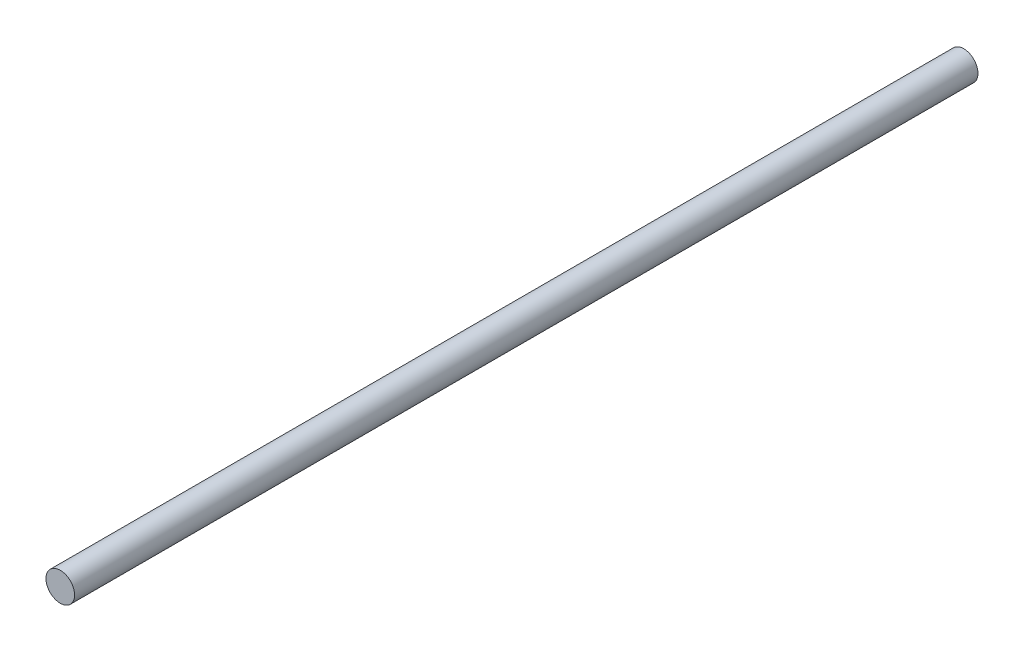
ISO-10303-21;
HEADER;
FILE_DESCRIPTION(('STEP AP214'),'2;1');
FILE_NAME('part.step','',(''),(''),'','','');
FILE_SCHEMA(('AUTOMOTIVE_DESIGN { 1 0 10303 214 1 1 1 1 }'));
ENDSEC;
DATA;
#1=APPLICATION_CONTEXT('core data for automotive mechanical design processes');
#2=APPLICATION_PROTOCOL_DEFINITION('international standard','automotive_design',2000,#1);
#3=PRODUCT_CONTEXT('',#1,'mechanical');
#4=PRODUCT('Part','Part','',(#3));
#5=PRODUCT_RELATED_PRODUCT_CATEGORY('part','',(#4));
#6=PRODUCT_DEFINITION_FORMATION('','',#4);
#7=PRODUCT_DEFINITION_CONTEXT('part definition',#1,'design');
#8=PRODUCT_DEFINITION('design','',#6,#7);
#9=PRODUCT_DEFINITION_SHAPE('','',#8);
#10=(LENGTH_UNIT() NAMED_UNIT(*) SI_UNIT(.MILLI.,.METRE.));
#11=(NAMED_UNIT(*) PLANE_ANGLE_UNIT() SI_UNIT($,.RADIAN.));
#12=(NAMED_UNIT(*) SI_UNIT($,.STERADIAN.) SOLID_ANGLE_UNIT());
#13=UNCERTAINTY_MEASURE_WITH_UNIT(LENGTH_MEASURE(1.E-05),#10,'distance_accuracy_value','');
#14=(GEOMETRIC_REPRESENTATION_CONTEXT(3) GLOBAL_UNCERTAINTY_ASSIGNED_CONTEXT((#13)) GLOBAL_UNIT_ASSIGNED_CONTEXT((#10,
#11,#12)) REPRESENTATION_CONTEXT('',''));
#15=CARTESIAN_POINT('',(0.,0.,0.));
#16=DIRECTION('',(0.,0.,1.));
#17=DIRECTION('',(1.,0.,0.));
#18=AXIS2_PLACEMENT_3D('',#15,#16,#17);
#19=CARTESIAN_POINT('',(0.,0.,152.4));
#20=DIRECTION('',(0.,0.,-1.));
#21=DIRECTION('',(-1.,0.,0.));
#22=AXIS2_PLACEMENT_3D('',#19,#20,#21);
#23=CYLINDRICAL_SURFACE('',#22,2.413);
#24=CARTESIAN_POINT('',(0.,0.,152.4));
#25=DIRECTION('',(0.,0.,1.));
#26=DIRECTION('',(1.,0.,0.));
#27=AXIS2_PLACEMENT_3D('',#24,#25,#26);
#28=CIRCLE('',#27,2.413);
#29=CARTESIAN_POINT('',(2.413,0.,152.4));
#30=VERTEX_POINT('',#29);
#31=EDGE_CURVE('E10',#30,#30,#28,.T.);
#32=ORIENTED_EDGE('',*,*,#31,.F.);
#33=EDGE_LOOP('',(#32));
#34=FACE_BOUND('',#33,.T.);
#35=CARTESIAN_POINT('',(0.,0.,0.));
#36=DIRECTION('',(0.,0.,1.));
#37=DIRECTION('',(1.,0.,0.));
#38=AXIS2_PLACEMENT_3D('',#35,#36,#37);
#39=CIRCLE('',#38,2.413);
#40=CARTESIAN_POINT('',(2.413,0.,0.));
#41=VERTEX_POINT('',#40);
#42=EDGE_CURVE('E33',#41,#41,#39,.T.);
#43=ORIENTED_EDGE('',*,*,#42,.T.);
#44=EDGE_LOOP('',(#43));
#45=FACE_BOUND('',#44,.T.);
#46=ADVANCED_FACE('F30',(#34,#45),#23,.T.);
#47=CARTESIAN_POINT('',(0.,0.,152.4));
#48=DIRECTION('',(0.,0.,1.));
#49=DIRECTION('',(1.,0.,0.));
#50=AXIS2_PLACEMENT_3D('',#47,#48,#49);
#51=PLANE('',#50);
#52=ORIENTED_EDGE('',*,*,#31,.T.);
#53=EDGE_LOOP('',(#52));
#54=FACE_BOUND('',#53,.T.);
#55=ADVANCED_FACE('F45',(#54),#51,.T.);
#56=CARTESIAN_POINT('',(0.,0.,0.));
#57=DIRECTION('',(0.,0.,1.));
#58=DIRECTION('',(1.,0.,0.));
#59=AXIS2_PLACEMENT_3D('',#56,#57,#58);
#60=PLANE('',#59);
#61=ORIENTED_EDGE('',*,*,#42,.F.);
#62=EDGE_LOOP('',(#61));
#63=FACE_BOUND('',#62,.T.);
#64=ADVANCED_FACE('F43',(#63),#60,.F.);
#65=CLOSED_SHELL('',(#46,#55,#64));
#66=MANIFOLD_SOLID_BREP('B2',#65);
#67=ADVANCED_BREP_SHAPE_REPRESENTATION('',(#18,#66),#14);
#68=SHAPE_DEFINITION_REPRESENTATION(#9,#67);
ENDSEC;
END-ISO-10303-21;
